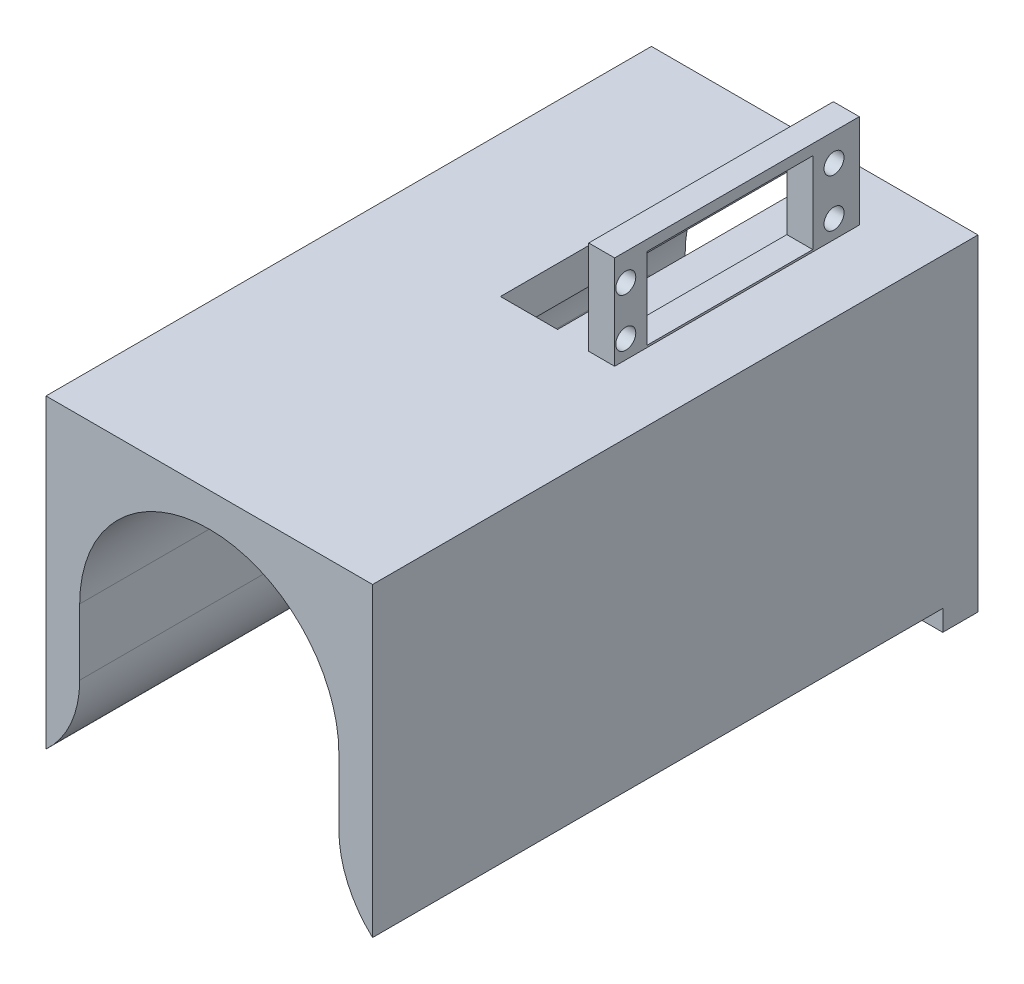
ISO-10303-21;
HEADER;
FILE_DESCRIPTION(('STEP AP214'),'2;1');
FILE_NAME('part.step','',(''),(''),'','','');
FILE_SCHEMA(('AUTOMOTIVE_DESIGN { 1 0 10303 214 1 1 1 1 }'));
ENDSEC;
DATA;
#1=APPLICATION_CONTEXT('core data for automotive mechanical design processes');
#2=APPLICATION_PROTOCOL_DEFINITION('international standard','automotive_design',2000,#1);
#3=PRODUCT_CONTEXT('',#1,'mechanical');
#4=PRODUCT('Part','Part','',(#3));
#5=PRODUCT_RELATED_PRODUCT_CATEGORY('part','',(#4));
#6=PRODUCT_DEFINITION_FORMATION('','',#4);
#7=PRODUCT_DEFINITION_CONTEXT('part definition',#1,'design');
#8=PRODUCT_DEFINITION('design','',#6,#7);
#9=PRODUCT_DEFINITION_SHAPE('','',#8);
#10=(LENGTH_UNIT() NAMED_UNIT(*) SI_UNIT(.MILLI.,.METRE.));
#11=(NAMED_UNIT(*) PLANE_ANGLE_UNIT() SI_UNIT($,.RADIAN.));
#12=(NAMED_UNIT(*) SI_UNIT($,.STERADIAN.) SOLID_ANGLE_UNIT());
#13=UNCERTAINTY_MEASURE_WITH_UNIT(LENGTH_MEASURE(1.E-05),#10,'distance_accuracy_value','');
#14=(GEOMETRIC_REPRESENTATION_CONTEXT(3) GLOBAL_UNCERTAINTY_ASSIGNED_CONTEXT((#13)) GLOBAL_UNIT_ASSIGNED_CONTEXT((#10,
#11,#12)) REPRESENTATION_CONTEXT('',''));
#15=CARTESIAN_POINT('',(0.,0.,0.));
#16=DIRECTION('',(0.,0.,1.));
#17=DIRECTION('',(1.,0.,0.));
#18=AXIS2_PLACEMENT_3D('',#15,#16,#17);
#19=CARTESIAN_POINT('',(-40.005,40.005,2.54));
#20=DIRECTION('',(0.,-1.,0.));
#21=DIRECTION('',(0.,0.,-1.));
#22=AXIS2_PLACEMENT_3D('',#19,#20,#21);
#23=PLANE('',#22);
#24=DIRECTION('',(-1.,0.,0.));
#25=VECTOR('',#24,1.);
#26=CARTESIAN_POINT('',(-40.005,40.005,0.));
#27=LINE('',#26,#25);
#28=CARTESIAN_POINT('',(40.005,40.005,0.));
#29=VERTEX_POINT('',#28);
#30=CARTESIAN_POINT('',(8.568,40.005,0.));
#31=VERTEX_POINT('',#30);
#32=EDGE_CURVE('E350',#29,#31,#27,.T.);
#33=ORIENTED_EDGE('',*,*,#32,.T.);
#34=DIRECTION('',(0.,0.,-1.));
#35=VECTOR('',#34,1.);
#36=CARTESIAN_POINT('',(8.568,40.005,71.5702352680382));
#37=LINE('',#36,#35);
#38=CARTESIAN_POINT('',(8.568,40.005,71.5702352680382));
#39=VERTEX_POINT('',#38);
#40=EDGE_CURVE('E201',#39,#31,#37,.T.);
#41=ORIENTED_EDGE('',*,*,#40,.F.);
#42=DIRECTION('',(1.,0.,0.));
#43=VECTOR('',#42,1.);
#44=CARTESIAN_POINT('',(8.568,40.005,71.5702352680382));
#45=LINE('',#44,#43);
#46=CARTESIAN_POINT('',(-5.432,40.005,71.5702352680382));
#47=VERTEX_POINT('',#46);
#48=EDGE_CURVE('E188',#47,#39,#45,.T.);
#49=ORIENTED_EDGE('',*,*,#48,.F.);
#50=DIRECTION('',(0.,0.,1.));
#51=VECTOR('',#50,1.);
#52=CARTESIAN_POINT('',(-5.432,40.005,71.5702352680382));
#53=LINE('',#52,#51);
#54=CARTESIAN_POINT('',(-5.432,40.005,0.));
#55=VERTEX_POINT('',#54);
#56=EDGE_CURVE('E195',#55,#47,#53,.T.);
#57=ORIENTED_EDGE('',*,*,#56,.F.);
#58=CARTESIAN_POINT('',(-40.005,40.005,0.));
#59=VERTEX_POINT('',#58);
#60=EDGE_CURVE('E349',#55,#59,#27,.T.);
#61=ORIENTED_EDGE('',*,*,#60,.T.);
#62=DIRECTION('',(0.,0.,-1.));
#63=VECTOR('',#62,1.);
#64=CARTESIAN_POINT('',(-40.005,40.005,2.54));
#65=LINE('',#64,#63);
#66=CARTESIAN_POINT('',(-40.005,40.005,148.336));
#67=VERTEX_POINT('',#66);
#68=EDGE_CURVE('E362',#67,#59,#65,.T.);
#69=ORIENTED_EDGE('',*,*,#68,.F.);
#70=DIRECTION('',(-1.,0.,0.));
#71=VECTOR('',#70,1.);
#72=CARTESIAN_POINT('',(-40.005,40.005,148.336));
#73=LINE('',#72,#71);
#74=CARTESIAN_POINT('',(40.005,40.005,148.336));
#75=VERTEX_POINT('',#74);
#76=EDGE_CURVE('E343',#75,#67,#73,.T.);
#77=ORIENTED_EDGE('',*,*,#76,.F.);
#78=DIRECTION('',(0.,0.,-1.));
#79=VECTOR('',#78,1.);
#80=CARTESIAN_POINT('',(40.005,40.005,2.54));
#81=LINE('',#80,#79);
#82=EDGE_CURVE('E365',#75,#29,#81,.T.);
#83=ORIENTED_EDGE('',*,*,#82,.T.);
#84=EDGE_LOOP('',(#33,#41,#49,#57,#61,#69,#77,#83));
#85=FACE_BOUND('',#84,.T.);
#86=DIRECTION('',(0.,0.,1.));
#87=VECTOR('',#86,1.);
#88=CARTESIAN_POINT('',(17.018,40.005,72.39));
#89=LINE('',#88,#87);
#90=CARTESIAN_POINT('',(17.018,40.005,12.446));
#91=VERTEX_POINT('',#90);
#92=CARTESIAN_POINT('',(17.018,40.005,72.39));
#93=VERTEX_POINT('',#92);
#94=EDGE_CURVE('E266',#91,#93,#89,.T.);
#95=ORIENTED_EDGE('',*,*,#94,.F.);
#96=DIRECTION('',(-1.,0.,0.));
#97=VECTOR('',#96,1.);
#98=CARTESIAN_POINT('',(23.368,40.005,12.446));
#99=LINE('',#98,#97);
#100=CARTESIAN_POINT('',(23.368,40.005,12.446));
#101=VERTEX_POINT('',#100);
#102=EDGE_CURVE('E271',#101,#91,#99,.T.);
#103=ORIENTED_EDGE('',*,*,#102,.F.);
#104=DIRECTION('',(0.,0.,-1.));
#105=VECTOR('',#104,1.);
#106=CARTESIAN_POINT('',(23.368,40.005,72.39));
#107=LINE('',#106,#105);
#108=CARTESIAN_POINT('',(23.368,40.005,72.39));
#109=VERTEX_POINT('',#108);
#110=EDGE_CURVE('E283',#109,#101,#107,.T.);
#111=ORIENTED_EDGE('',*,*,#110,.F.);
#112=DIRECTION('',(1.,0.,0.));
#113=VECTOR('',#112,1.);
#114=CARTESIAN_POINT('',(23.368,40.005,72.39));
#115=LINE('',#114,#113);
#116=EDGE_CURVE('E280',#93,#109,#115,.T.);
#117=ORIENTED_EDGE('',*,*,#116,.F.);
#118=EDGE_LOOP('',(#95,#103,#111,#117));
#119=FACE_BOUND('',#118,.T.);
#120=ADVANCED_FACE('F37',(#85,#119),#23,.F.);
#121=CARTESIAN_POINT('',(0.,0.,148.336));
#122=DIRECTION('',(0.,0.,1.));
#123=DIRECTION('',(1.,0.,0.));
#124=AXIS2_PLACEMENT_3D('',#121,#122,#123);
#125=PLANE('',#124);
#126=DIRECTION('',(0.,-1.,0.));
#127=VECTOR('',#126,1.);
#128=CARTESIAN_POINT('',(31.75,0.,148.336));
#129=LINE('',#128,#127);
#130=CARTESIAN_POINT('',(31.75,0.,148.336));
#131=VERTEX_POINT('',#130);
#132=CARTESIAN_POINT('',(31.75,-16.1844297045154,148.336));
#133=VERTEX_POINT('',#132);
#134=EDGE_CURVE('E299',#131,#133,#129,.T.);
#135=ORIENTED_EDGE('',*,*,#134,.T.);
#136=CARTESIAN_POINT('',(57.15,-16.1844297045154,148.336));
#137=DIRECTION('',(0.,0.,1.));
#138=DIRECTION('',(1.,0.,0.));
#139=AXIS2_PLACEMENT_3D('',#136,#137,#138);
#140=CIRCLE('',#139,25.4);
#141=CARTESIAN_POINT('',(40.005,-34.925,148.336));
#142=VERTEX_POINT('',#141);
#143=EDGE_CURVE('E373',#133,#142,#140,.T.);
#144=ORIENTED_EDGE('',*,*,#143,.T.);
#145=DIRECTION('',(0.,1.,0.));
#146=VECTOR('',#145,1.);
#147=CARTESIAN_POINT('',(40.005,40.005,148.336));
#148=LINE('',#147,#146);
#149=EDGE_CURVE('E341',#142,#75,#148,.T.);
#150=ORIENTED_EDGE('',*,*,#149,.T.);
#151=ORIENTED_EDGE('',*,*,#76,.T.);
#152=DIRECTION('',(0.,-1.,0.));
#153=VECTOR('',#152,1.);
#154=CARTESIAN_POINT('',(-40.005,40.005,148.336));
#155=LINE('',#154,#153);
#156=CARTESIAN_POINT('',(-40.005,-34.925,148.336));
#157=VERTEX_POINT('',#156);
#158=EDGE_CURVE('E338',#67,#157,#155,.T.);
#159=ORIENTED_EDGE('',*,*,#158,.T.);
#160=CARTESIAN_POINT('',(-57.15,-16.1844297045154,148.336));
#161=DIRECTION('',(0.,0.,1.));
#162=DIRECTION('',(1.,0.,0.));
#163=AXIS2_PLACEMENT_3D('',#160,#161,#162);
#164=CIRCLE('',#163,25.4);
#165=CARTESIAN_POINT('',(-31.75,-16.1844297045154,148.336));
#166=VERTEX_POINT('',#165);
#167=EDGE_CURVE('E371',#157,#166,#164,.T.);
#168=ORIENTED_EDGE('',*,*,#167,.T.);
#169=DIRECTION('',(0.,-1.,0.));
#170=VECTOR('',#169,1.);
#171=CARTESIAN_POINT('',(-31.75,0.,148.336));
#172=LINE('',#171,#170);
#173=CARTESIAN_POINT('',(-31.75,0.,148.336));
#174=VERTEX_POINT('',#173);
#175=EDGE_CURVE('E304',#174,#166,#172,.T.);
#176=ORIENTED_EDGE('',*,*,#175,.F.);
#177=CARTESIAN_POINT('',(0.,0.,148.336));
#178=DIRECTION('',(0.,0.,1.));
#179=DIRECTION('',(1.,0.,0.));
#180=AXIS2_PLACEMENT_3D('',#177,#178,#179);
#181=CIRCLE('',#180,31.75);
#182=EDGE_CURVE('E317',#131,#174,#181,.T.);
#183=ORIENTED_EDGE('',*,*,#182,.F.);
#184=EDGE_LOOP('',(#135,#144,#150,#151,#159,#168,#176,#183));
#185=FACE_BOUND('',#184,.T.);
#186=ADVANCED_FACE('F398',(#185),#125,.T.);
#187=CARTESIAN_POINT('',(40.005,-40.005,2.54));
#188=DIRECTION('',(-1.,0.,0.));
#189=DIRECTION('',(0.,0.,1.));
#190=AXIS2_PLACEMENT_3D('',#187,#188,#189);
#191=PLANE('',#190);
#192=DIRECTION('',(0.,0.,1.));
#193=VECTOR('',#192,1.);
#194=CARTESIAN_POINT('',(40.005,-34.925,0.));
#195=LINE('',#194,#193);
#196=CARTESIAN_POINT('',(40.005,-34.925,8.636));
#197=VERTEX_POINT('',#196);
#198=EDGE_CURVE('E326',#197,#142,#195,.T.);
#199=ORIENTED_EDGE('',*,*,#198,.F.);
#200=DIRECTION('',(0.,-1.,0.));
#201=VECTOR('',#200,1.);
#202=CARTESIAN_POINT('',(40.005,-34.925,8.636));
#203=LINE('',#202,#201);
#204=CARTESIAN_POINT('',(40.005,-40.005,8.636));
#205=VERTEX_POINT('',#204);
#206=EDGE_CURVE('E331',#197,#205,#203,.T.);
#207=ORIENTED_EDGE('',*,*,#206,.T.);
#208=DIRECTION('',(0.,0.,-1.));
#209=VECTOR('',#208,1.);
#210=CARTESIAN_POINT('',(40.005,-40.005,2.54));
#211=LINE('',#210,#209);
#212=CARTESIAN_POINT('',(40.005,-40.005,0.));
#213=VERTEX_POINT('',#212);
#214=EDGE_CURVE('E358',#205,#213,#211,.T.);
#215=ORIENTED_EDGE('',*,*,#214,.T.);
#216=DIRECTION('',(0.,1.,0.));
#217=VECTOR('',#216,1.);
#218=CARTESIAN_POINT('',(40.005,-40.005,0.));
#219=LINE('',#218,#217);
#220=EDGE_CURVE('E346',#213,#29,#219,.T.);
#221=ORIENTED_EDGE('',*,*,#220,.T.);
#222=ORIENTED_EDGE('',*,*,#82,.F.);
#223=ORIENTED_EDGE('',*,*,#149,.F.);
#224=EDGE_LOOP('',(#199,#207,#215,#221,#222,#223));
#225=FACE_BOUND('',#224,.T.);
#226=ADVANCED_FACE('F405',(#225),#191,.F.);
#227=CARTESIAN_POINT('',(-40.005,-40.005,2.54));
#228=DIRECTION('',(1.,0.,0.));
#229=DIRECTION('',(0.,0.,-1.));
#230=AXIS2_PLACEMENT_3D('',#227,#228,#229);
#231=PLANE('',#230);
#232=DIRECTION('',(0.,0.,-1.));
#233=VECTOR('',#232,1.);
#234=CARTESIAN_POINT('',(-40.005,-40.005,2.54));
#235=LINE('',#234,#233);
#236=CARTESIAN_POINT('',(-40.005,-40.005,8.636));
#237=VERTEX_POINT('',#236);
#238=CARTESIAN_POINT('',(-40.005,-40.005,0.));
#239=VERTEX_POINT('',#238);
#240=EDGE_CURVE('E360',#237,#239,#235,.T.);
#241=ORIENTED_EDGE('',*,*,#240,.F.);
#242=DIRECTION('',(0.,-1.,0.));
#243=VECTOR('',#242,1.);
#244=CARTESIAN_POINT('',(-40.005,-34.925,8.636));
#245=LINE('',#244,#243);
#246=CARTESIAN_POINT('',(-40.005,-34.925,8.636));
#247=VERTEX_POINT('',#246);
#248=EDGE_CURVE('E329',#247,#237,#245,.T.);
#249=ORIENTED_EDGE('',*,*,#248,.F.);
#250=DIRECTION('',(0.,0.,-1.));
#251=VECTOR('',#250,1.);
#252=CARTESIAN_POINT('',(-40.005,-34.925,0.));
#253=LINE('',#252,#251);
#254=EDGE_CURVE('E323',#157,#247,#253,.T.);
#255=ORIENTED_EDGE('',*,*,#254,.F.);
#256=ORIENTED_EDGE('',*,*,#158,.F.);
#257=ORIENTED_EDGE('',*,*,#68,.T.);
#258=DIRECTION('',(0.,-1.,0.));
#259=VECTOR('',#258,1.);
#260=CARTESIAN_POINT('',(-40.005,-40.005,0.));
#261=LINE('',#260,#259);
#262=EDGE_CURVE('E352',#59,#239,#261,.T.);
#263=ORIENTED_EDGE('',*,*,#262,.T.);
#264=EDGE_LOOP('',(#241,#249,#255,#256,#257,#263));
#265=FACE_BOUND('',#264,.T.);
#266=ADVANCED_FACE('F394',(#265),#231,.F.);
#267=CARTESIAN_POINT('',(-40.005,-40.005,2.54));
#268=DIRECTION('',(0.,1.,0.));
#269=DIRECTION('',(0.,0.,1.));
#270=AXIS2_PLACEMENT_3D('',#267,#268,#269);
#271=PLANE('',#270);
#272=ORIENTED_EDGE('',*,*,#214,.F.);
#273=DIRECTION('',(1.,0.,0.));
#274=VECTOR('',#273,1.);
#275=CARTESIAN_POINT('',(0.,-40.005,8.636));
#276=LINE('',#275,#274);
#277=EDGE_CURVE('E322',#237,#205,#276,.T.);
#278=ORIENTED_EDGE('',*,*,#277,.F.);
#279=ORIENTED_EDGE('',*,*,#240,.T.);
#280=DIRECTION('',(1.,0.,0.));
#281=VECTOR('',#280,1.);
#282=CARTESIAN_POINT('',(-40.005,-40.005,0.));
#283=LINE('',#282,#281);
#284=EDGE_CURVE('E355',#239,#213,#283,.T.);
#285=ORIENTED_EDGE('',*,*,#284,.T.);
#286=EDGE_LOOP('',(#272,#278,#279,#285));
#287=FACE_BOUND('',#286,.T.);
#288=ADVANCED_FACE('F456',(#287),#271,.F.);
#289=CARTESIAN_POINT('',(0.,0.,0.));
#290=DIRECTION('',(0.,0.,-1.));
#291=DIRECTION('',(-1.,0.,0.));
#292=AXIS2_PLACEMENT_3D('',#289,#290,#291);
#293=PLANE('',#292);
#294=DIRECTION('',(0.,-1.,0.));
#295=VECTOR('',#294,1.);
#296=CARTESIAN_POINT('',(8.568,0.,0.));
#297=LINE('',#296,#295);
#298=CARTESIAN_POINT('',(8.568,30.5720767367871,0.));
#299=VERTEX_POINT('',#298);
#300=EDGE_CURVE('E210',#31,#299,#297,.T.);
#301=ORIENTED_EDGE('',*,*,#300,.F.);
#302=ORIENTED_EDGE('',*,*,#32,.F.);
#303=ORIENTED_EDGE('',*,*,#220,.F.);
#304=ORIENTED_EDGE('',*,*,#284,.F.);
#305=ORIENTED_EDGE('',*,*,#262,.F.);
#306=ORIENTED_EDGE('',*,*,#60,.F.);
#307=DIRECTION('',(0.,1.,0.));
#308=VECTOR('',#307,1.);
#309=CARTESIAN_POINT('',(-5.432,0.,0.));
#310=LINE('',#309,#308);
#311=CARTESIAN_POINT('',(-5.432,31.2818777569378,0.));
#312=VERTEX_POINT('',#311);
#313=EDGE_CURVE('E198',#312,#55,#310,.T.);
#314=ORIENTED_EDGE('',*,*,#313,.F.);
#315=CARTESIAN_POINT('',(0.,0.,0.));
#316=DIRECTION('',(0.,0.,-1.));
#317=DIRECTION('',(-1.,0.,0.));
#318=AXIS2_PLACEMENT_3D('',#315,#316,#317);
#319=CIRCLE('',#318,31.75);
#320=EDGE_CURVE('E334',#299,#312,#319,.T.);
#321=ORIENTED_EDGE('',*,*,#320,.F.);
#322=EDGE_LOOP('',(#301,#302,#303,#304,#305,#306,#314,#321));
#323=FACE_BOUND('',#322,.T.);
#324=ADVANCED_FACE('F387',(#323),#293,.T.);
#325=CARTESIAN_POINT('',(0.,0.,69.85));
#326=DIRECTION('',(0.,0.,-1.));
#327=DIRECTION('',(-1.,0.,0.));
#328=AXIS2_PLACEMENT_3D('',#325,#326,#327);
#329=CYLINDRICAL_SURFACE('',#328,31.75);
#330=CARTESIAN_POINT('',(0.,0.,8.636));
#331=DIRECTION('',(0.,0.,1.));
#332=DIRECTION('',(1.,0.,0.));
#333=AXIS2_PLACEMENT_3D('',#330,#331,#332);
#334=CIRCLE('',#333,31.75);
#335=CARTESIAN_POINT('',(31.75,0.,8.636));
#336=VERTEX_POINT('',#335);
#337=CARTESIAN_POINT('',(-31.75,0.,8.636));
#338=VERTEX_POINT('',#337);
#339=EDGE_CURVE('E303',#336,#338,#334,.F.);
#340=ORIENTED_EDGE('',*,*,#339,.F.);
#341=DIRECTION('',(0.,0.,1.));
#342=VECTOR('',#341,1.);
#343=CARTESIAN_POINT('',(31.75,0.,8.636));
#344=LINE('',#343,#342);
#345=EDGE_CURVE('E310',#336,#131,#344,.T.);
#346=ORIENTED_EDGE('',*,*,#345,.T.);
#347=ORIENTED_EDGE('',*,*,#182,.T.);
#348=DIRECTION('',(0.,0.,1.));
#349=VECTOR('',#348,1.);
#350=CARTESIAN_POINT('',(-31.75,0.,8.636));
#351=LINE('',#350,#349);
#352=EDGE_CURVE('E315',#338,#174,#351,.T.);
#353=ORIENTED_EDGE('',*,*,#352,.F.);
#354=EDGE_LOOP('',(#340,#346,#347,#353));
#355=FACE_BOUND('',#354,.T.);
#356=CARTESIAN_POINT('',(0.,0.,71.5702352680382));
#357=DIRECTION('',(0.,0.,1.));
#358=DIRECTION('',(1.,0.,0.));
#359=AXIS2_PLACEMENT_3D('',#356,#357,#358);
#360=CIRCLE('',#359,31.75);
#361=CARTESIAN_POINT('',(-5.432,31.2818777569378,71.5702352680382));
#362=VERTEX_POINT('',#361);
#363=CARTESIAN_POINT('',(8.568,30.5720767367871,71.5702352680382));
#364=VERTEX_POINT('',#363);
#365=EDGE_CURVE('E45',#362,#364,#360,.F.);
#366=ORIENTED_EDGE('',*,*,#365,.T.);
#367=DIRECTION('',(0.,0.,-1.));
#368=VECTOR('',#367,1.);
#369=CARTESIAN_POINT('',(8.568,30.5720767367871,69.85));
#370=LINE('',#369,#368);
#371=EDGE_CURVE('E11',#364,#299,#370,.T.);
#372=ORIENTED_EDGE('',*,*,#371,.T.);
#373=ORIENTED_EDGE('',*,*,#320,.T.);
#374=DIRECTION('',(0.,0.,-1.));
#375=VECTOR('',#374,1.);
#376=CARTESIAN_POINT('',(-5.432,31.2818777569378,69.85));
#377=LINE('',#376,#375);
#378=EDGE_CURVE('E381',#312,#362,#377,.F.);
#379=ORIENTED_EDGE('',*,*,#378,.T.);
#380=EDGE_LOOP('',(#366,#372,#373,#379));
#381=FACE_BOUND('',#380,.T.);
#382=ADVANCED_FACE('F383',(#355,#381),#329,.F.);
#383=CARTESIAN_POINT('',(0.,-34.925,8.636));
#384=DIRECTION('',(0.,0.,-1.));
#385=DIRECTION('',(-1.,0.,0.));
#386=AXIS2_PLACEMENT_3D('',#383,#384,#385);
#387=PLANE('',#386);
#388=ORIENTED_EDGE('',*,*,#277,.T.);
#389=ORIENTED_EDGE('',*,*,#206,.F.);
#390=CARTESIAN_POINT('',(57.15,-16.1844297045154,8.636));
#391=DIRECTION('',(0.,0.,-1.));
#392=DIRECTION('',(-1.,0.,0.));
#393=AXIS2_PLACEMENT_3D('',#390,#391,#392);
#394=CIRCLE('',#393,25.4);
#395=CARTESIAN_POINT('',(31.75,-16.1844297045154,8.636));
#396=VERTEX_POINT('',#395);
#397=EDGE_CURVE('E377',#197,#396,#394,.T.);
#398=ORIENTED_EDGE('',*,*,#397,.T.);
#399=DIRECTION('',(0.,-1.,0.));
#400=VECTOR('',#399,1.);
#401=CARTESIAN_POINT('',(31.75,0.,8.636));
#402=LINE('',#401,#400);
#403=EDGE_CURVE('E300',#336,#396,#402,.T.);
#404=ORIENTED_EDGE('',*,*,#403,.F.);
#405=ORIENTED_EDGE('',*,*,#339,.T.);
#406=DIRECTION('',(0.,-1.,0.));
#407=VECTOR('',#406,1.);
#408=CARTESIAN_POINT('',(-31.75,0.,8.636));
#409=LINE('',#408,#407);
#410=CARTESIAN_POINT('',(-31.75,-16.1844297045154,8.636));
#411=VERTEX_POINT('',#410);
#412=EDGE_CURVE('E307',#338,#411,#409,.T.);
#413=ORIENTED_EDGE('',*,*,#412,.T.);
#414=CARTESIAN_POINT('',(-57.15,-16.1844297045154,8.636));
#415=DIRECTION('',(0.,0.,-1.));
#416=DIRECTION('',(-1.,0.,0.));
#417=AXIS2_PLACEMENT_3D('',#414,#415,#416);
#418=CIRCLE('',#417,25.4);
#419=EDGE_CURVE('E379',#411,#247,#418,.T.);
#420=ORIENTED_EDGE('',*,*,#419,.T.);
#421=ORIENTED_EDGE('',*,*,#248,.T.);
#422=EDGE_LOOP('',(#388,#389,#398,#404,#405,#413,#420,#421));
#423=FACE_BOUND('',#422,.T.);
#424=ADVANCED_FACE('F446',(#423),#387,.F.);
#425=CARTESIAN_POINT('',(31.75,0.,8.636));
#426=DIRECTION('',(-1.,0.,0.));
#427=DIRECTION('',(0.,0.,1.));
#428=AXIS2_PLACEMENT_3D('',#425,#426,#427);
#429=PLANE('',#428);
#430=ORIENTED_EDGE('',*,*,#403,.T.);
#431=DIRECTION('',(0.,0.,1.));
#432=VECTOR('',#431,1.);
#433=CARTESIAN_POINT('',(31.75,-16.1844297045154,148.336));
#434=LINE('',#433,#432);
#435=EDGE_CURVE('E368',#396,#133,#434,.T.);
#436=ORIENTED_EDGE('',*,*,#435,.T.);
#437=ORIENTED_EDGE('',*,*,#134,.F.);
#438=ORIENTED_EDGE('',*,*,#345,.F.);
#439=EDGE_LOOP('',(#430,#436,#437,#438));
#440=FACE_BOUND('',#439,.T.);
#441=ADVANCED_FACE('F439',(#440),#429,.T.);
#442=CARTESIAN_POINT('',(-31.75,0.,8.636));
#443=DIRECTION('',(-1.,0.,0.));
#444=DIRECTION('',(0.,0.,1.));
#445=AXIS2_PLACEMENT_3D('',#442,#443,#444);
#446=PLANE('',#445);
#447=ORIENTED_EDGE('',*,*,#175,.T.);
#448=DIRECTION('',(0.,0.,1.));
#449=VECTOR('',#448,1.);
#450=CARTESIAN_POINT('',(-31.75,-16.1844297045154,8.636));
#451=LINE('',#450,#449);
#452=EDGE_CURVE('E375',#166,#411,#451,.F.);
#453=ORIENTED_EDGE('',*,*,#452,.T.);
#454=ORIENTED_EDGE('',*,*,#412,.F.);
#455=ORIENTED_EDGE('',*,*,#352,.T.);
#456=EDGE_LOOP('',(#447,#453,#454,#455));
#457=FACE_BOUND('',#456,.T.);
#458=ADVANCED_FACE('F431',(#457),#446,.F.);
#459=CARTESIAN_POINT('',(57.15,-16.1844297045154,0.));
#460=DIRECTION('',(0.,0.,-1.));
#461=DIRECTION('',(-1.,0.,0.));
#462=AXIS2_PLACEMENT_3D('',#459,#460,#461);
#463=CYLINDRICAL_SURFACE('',#462,25.4);
#464=ORIENTED_EDGE('',*,*,#397,.F.);
#465=ORIENTED_EDGE('',*,*,#198,.T.);
#466=ORIENTED_EDGE('',*,*,#143,.F.);
#467=ORIENTED_EDGE('',*,*,#435,.F.);
#468=EDGE_LOOP('',(#464,#465,#466,#467));
#469=FACE_BOUND('',#468,.T.);
#470=ADVANCED_FACE('F429',(#469),#463,.T.);
#471=CARTESIAN_POINT('',(-57.15,-16.1844297045154,0.));
#472=DIRECTION('',(0.,0.,1.));
#473=DIRECTION('',(1.,0.,0.));
#474=AXIS2_PLACEMENT_3D('',#471,#472,#473);
#475=CYLINDRICAL_SURFACE('',#474,25.4);
#476=ORIENTED_EDGE('',*,*,#419,.F.);
#477=ORIENTED_EDGE('',*,*,#452,.F.);
#478=ORIENTED_EDGE('',*,*,#167,.F.);
#479=ORIENTED_EDGE('',*,*,#254,.T.);
#480=EDGE_LOOP('',(#476,#477,#478,#479));
#481=FACE_BOUND('',#480,.T.);
#482=ADVANCED_FACE('F39',(#481),#475,.T.);
#483=CARTESIAN_POINT('',(17.018,63.005,72.39));
#484=DIRECTION('',(1.,0.,0.));
#485=DIRECTION('',(0.,0.,-1.));
#486=AXIS2_PLACEMENT_3D('',#483,#484,#485);
#487=PLANE('',#486);
#488=CARTESIAN_POINT('',(17.018,56.2444527708158,18.6392147090301));
#489=DIRECTION('',(1.,0.,0.));
#490=DIRECTION('',(0.,0.,-1.));
#491=AXIS2_PLACEMENT_3D('',#488,#489,#490);
#492=CIRCLE('',#491,2.45000000000003);
#493=CARTESIAN_POINT('',(17.018,56.2444527708158,16.1892147090301));
#494=VERTEX_POINT('',#493);
#495=EDGE_CURVE('E263',#494,#494,#492,.T.);
#496=ORIENTED_EDGE('',*,*,#495,.T.);
#497=EDGE_LOOP('',(#496));
#498=FACE_BOUND('',#497,.T.);
#499=CARTESIAN_POINT('',(17.018,44.502596374907,18.6392147090301));
#500=DIRECTION('',(1.,0.,0.));
#501=DIRECTION('',(0.,0.,-1.));
#502=AXIS2_PLACEMENT_3D('',#499,#500,#501);
#503=CIRCLE('',#502,2.45);
#504=CARTESIAN_POINT('',(17.018,44.502596374907,16.1892147090301));
#505=VERTEX_POINT('',#504);
#506=EDGE_CURVE('E260',#505,#505,#503,.T.);
#507=ORIENTED_EDGE('',*,*,#506,.T.);
#508=EDGE_LOOP('',(#507));
#509=FACE_BOUND('',#508,.T.);
#510=CARTESIAN_POINT('',(17.018,56.4025963749075,69.6592147090301));
#511=DIRECTION('',(1.,0.,0.));
#512=DIRECTION('',(0.,0.,-1.));
#513=AXIS2_PLACEMENT_3D('',#510,#511,#512);
#514=CIRCLE('',#513,2.45000000000003);
#515=CARTESIAN_POINT('',(17.018,56.4025963749075,67.2092147090301));
#516=VERTEX_POINT('',#515);
#517=EDGE_CURVE('E257',#516,#516,#514,.T.);
#518=ORIENTED_EDGE('',*,*,#517,.T.);
#519=EDGE_LOOP('',(#518));
#520=FACE_BOUND('',#519,.T.);
#521=CARTESIAN_POINT('',(17.018,44.5025963749075,69.6592147090301));
#522=DIRECTION('',(1.,0.,0.));
#523=DIRECTION('',(0.,0.,-1.));
#524=AXIS2_PLACEMENT_3D('',#521,#522,#523);
#525=CIRCLE('',#524,2.45);
#526=CARTESIAN_POINT('',(17.018,44.5025963749075,67.2092147090301));
#527=VERTEX_POINT('',#526);
#528=EDGE_CURVE('E254',#527,#527,#525,.T.);
#529=ORIENTED_EDGE('',*,*,#528,.T.);
#530=EDGE_LOOP('',(#529));
#531=FACE_BOUND('',#530,.T.);
#532=DIRECTION('',(0.,0.,1.));
#533=VECTOR('',#532,1.);
#534=CARTESIAN_POINT('',(17.018,60.4025963749075,72.39));
#535=LINE('',#534,#533);
#536=CARTESIAN_POINT('',(17.018,60.4025963749075,23.8492147090301));
#537=VERTEX_POINT('',#536);
#538=CARTESIAN_POINT('',(17.018,60.4025963749075,64.4492147090301));
#539=VERTEX_POINT('',#538);
#540=EDGE_CURVE('E248',#537,#539,#535,.T.);
#541=ORIENTED_EDGE('',*,*,#540,.T.);
#542=DIRECTION('',(0.,-1.,0.));
#543=VECTOR('',#542,1.);
#544=CARTESIAN_POINT('',(17.018,63.005,64.4492147090301));
#545=LINE('',#544,#543);
#546=CARTESIAN_POINT('',(17.018,40.5025963749075,64.4492147090301));
#547=VERTEX_POINT('',#546);
#548=EDGE_CURVE('E251',#539,#547,#545,.T.);
#549=ORIENTED_EDGE('',*,*,#548,.T.);
#550=DIRECTION('',(0.,0.,-1.));
#551=VECTOR('',#550,1.);
#552=CARTESIAN_POINT('',(17.018,40.5025963749075,72.39));
#553=LINE('',#552,#551);
#554=CARTESIAN_POINT('',(17.018,40.5025963749075,23.8492147090301));
#555=VERTEX_POINT('',#554);
#556=EDGE_CURVE('E237',#547,#555,#553,.T.);
#557=ORIENTED_EDGE('',*,*,#556,.T.);
#558=DIRECTION('',(0.,1.,0.));
#559=VECTOR('',#558,1.);
#560=CARTESIAN_POINT('',(17.018,63.005,23.8492147090301));
#561=LINE('',#560,#559);
#562=EDGE_CURVE('E245',#555,#537,#561,.T.);
#563=ORIENTED_EDGE('',*,*,#562,.T.);
#564=EDGE_LOOP('',(#541,#549,#557,#563));
#565=FACE_BOUND('',#564,.T.);
#566=ORIENTED_EDGE('',*,*,#94,.T.);
#567=DIRECTION('',(0.,-1.,0.));
#568=VECTOR('',#567,1.);
#569=CARTESIAN_POINT('',(17.018,63.005,72.39));
#570=LINE('',#569,#568);
#571=CARTESIAN_POINT('',(17.018,63.005,72.39));
#572=VERTEX_POINT('',#571);
#573=EDGE_CURVE('E296',#572,#93,#570,.T.);
#574=ORIENTED_EDGE('',*,*,#573,.F.);
#575=DIRECTION('',(0.,0.,1.));
#576=VECTOR('',#575,1.);
#577=CARTESIAN_POINT('',(17.018,63.005,72.39));
#578=LINE('',#577,#576);
#579=CARTESIAN_POINT('',(17.018,63.005,12.446));
#580=VERTEX_POINT('',#579);
#581=EDGE_CURVE('E267',#580,#572,#578,.T.);
#582=ORIENTED_EDGE('',*,*,#581,.F.);
#583=DIRECTION('',(0.,-1.,0.));
#584=VECTOR('',#583,1.);
#585=CARTESIAN_POINT('',(17.018,63.005,12.446));
#586=LINE('',#585,#584);
#587=EDGE_CURVE('E277',#580,#91,#586,.T.);
#588=ORIENTED_EDGE('',*,*,#587,.T.);
#589=EDGE_LOOP('',(#566,#574,#582,#588));
#590=FACE_BOUND('',#589,.T.);
#591=ADVANCED_FACE('F437',(#498,#509,#520,#531,#565,#590),#487,.F.);
#592=CARTESIAN_POINT('',(23.368,63.005,72.39));
#593=DIRECTION('',(0.,0.,-1.));
#594=DIRECTION('',(-1.,0.,0.));
#595=AXIS2_PLACEMENT_3D('',#592,#593,#594);
#596=PLANE('',#595);
#597=ORIENTED_EDGE('',*,*,#116,.T.);
#598=DIRECTION('',(0.,-1.,0.));
#599=VECTOR('',#598,1.);
#600=CARTESIAN_POINT('',(23.368,63.005,72.39));
#601=LINE('',#600,#599);
#602=CARTESIAN_POINT('',(23.368,63.005,72.39));
#603=VERTEX_POINT('',#602);
#604=EDGE_CURVE('E293',#603,#109,#601,.T.);
#605=ORIENTED_EDGE('',*,*,#604,.F.);
#606=DIRECTION('',(1.,0.,0.));
#607=VECTOR('',#606,1.);
#608=CARTESIAN_POINT('',(23.368,63.005,72.39));
#609=LINE('',#608,#607);
#610=EDGE_CURVE('E270',#572,#603,#609,.T.);
#611=ORIENTED_EDGE('',*,*,#610,.F.);
#612=ORIENTED_EDGE('',*,*,#573,.T.);
#613=EDGE_LOOP('',(#597,#605,#611,#612));
#614=FACE_BOUND('',#613,.T.);
#615=ADVANCED_FACE('F472',(#614),#596,.F.);
#616=CARTESIAN_POINT('',(23.368,63.005,72.39));
#617=DIRECTION('',(-1.,0.,0.));
#618=DIRECTION('',(0.,0.,1.));
#619=AXIS2_PLACEMENT_3D('',#616,#617,#618);
#620=PLANE('',#619);
#621=CARTESIAN_POINT('',(23.368,56.2444527708158,18.6392147090301));
#622=DIRECTION('',(1.,0.,0.));
#623=DIRECTION('',(0.,0.,-1.));
#624=AXIS2_PLACEMENT_3D('',#621,#622,#623);
#625=CIRCLE('',#624,2.45000000000003);
#626=CARTESIAN_POINT('',(23.368,56.2444527708158,16.1892147090301));
#627=VERTEX_POINT('',#626);
#628=EDGE_CURVE('E212',#627,#627,#625,.T.);
#629=ORIENTED_EDGE('',*,*,#628,.F.);
#630=EDGE_LOOP('',(#629));
#631=FACE_BOUND('',#630,.T.);
#632=CARTESIAN_POINT('',(23.368,44.502596374907,18.6392147090301));
#633=DIRECTION('',(1.,0.,0.));
#634=DIRECTION('',(0.,0.,-1.));
#635=AXIS2_PLACEMENT_3D('',#632,#633,#634);
#636=CIRCLE('',#635,2.45);
#637=CARTESIAN_POINT('',(23.368,44.502596374907,16.1892147090301));
#638=VERTEX_POINT('',#637);
#639=EDGE_CURVE('E220',#638,#638,#636,.T.);
#640=ORIENTED_EDGE('',*,*,#639,.F.);
#641=EDGE_LOOP('',(#640));
#642=FACE_BOUND('',#641,.T.);
#643=CARTESIAN_POINT('',(23.368,56.4025963749075,69.6592147090301));
#644=DIRECTION('',(1.,0.,0.));
#645=DIRECTION('',(0.,0.,-1.));
#646=AXIS2_PLACEMENT_3D('',#643,#644,#645);
#647=CIRCLE('',#646,2.45000000000003);
#648=CARTESIAN_POINT('',(23.368,56.4025963749075,67.2092147090301));
#649=VERTEX_POINT('',#648);
#650=EDGE_CURVE('E217',#649,#649,#647,.T.);
#651=ORIENTED_EDGE('',*,*,#650,.F.);
#652=EDGE_LOOP('',(#651));
#653=FACE_BOUND('',#652,.T.);
#654=CARTESIAN_POINT('',(23.368,44.5025963749075,69.6592147090301));
#655=DIRECTION('',(1.,0.,0.));
#656=DIRECTION('',(0.,0.,-1.));
#657=AXIS2_PLACEMENT_3D('',#654,#655,#656);
#658=CIRCLE('',#657,2.45);
#659=CARTESIAN_POINT('',(23.368,44.5025963749075,67.2092147090301));
#660=VERTEX_POINT('',#659);
#661=EDGE_CURVE('E213',#660,#660,#658,.T.);
#662=ORIENTED_EDGE('',*,*,#661,.F.);
#663=EDGE_LOOP('',(#662));
#664=FACE_BOUND('',#663,.T.);
#665=DIRECTION('',(0.,0.,-1.));
#666=VECTOR('',#665,1.);
#667=CARTESIAN_POINT('',(23.368,40.5025963749075,64.4492147090301));
#668=LINE('',#667,#666);
#669=CARTESIAN_POINT('',(23.368,40.5025963749075,64.4492147090301));
#670=VERTEX_POINT('',#669);
#671=CARTESIAN_POINT('',(23.368,40.5025963749075,23.8492147090301));
#672=VERTEX_POINT('',#671);
#673=EDGE_CURVE('E226',#670,#672,#668,.T.);
#674=ORIENTED_EDGE('',*,*,#673,.F.);
#675=DIRECTION('',(0.,-1.,0.));
#676=VECTOR('',#675,1.);
#677=CARTESIAN_POINT('',(23.368,40.5025963749075,64.4492147090301));
#678=LINE('',#677,#676);
#679=CARTESIAN_POINT('',(23.368,60.4025963749075,64.4492147090301));
#680=VERTEX_POINT('',#679);
#681=EDGE_CURVE('E216',#680,#670,#678,.T.);
#682=ORIENTED_EDGE('',*,*,#681,.F.);
#683=DIRECTION('',(0.,0.,1.));
#684=VECTOR('',#683,1.);
#685=CARTESIAN_POINT('',(23.368,60.4025963749075,64.4492147090301));
#686=LINE('',#685,#684);
#687=CARTESIAN_POINT('',(23.368,60.4025963749075,23.8492147090301));
#688=VERTEX_POINT('',#687);
#689=EDGE_CURVE('E231',#688,#680,#686,.T.);
#690=ORIENTED_EDGE('',*,*,#689,.F.);
#691=DIRECTION('',(0.,1.,0.));
#692=VECTOR('',#691,1.);
#693=CARTESIAN_POINT('',(23.368,40.5025963749075,23.8492147090301));
#694=LINE('',#693,#692);
#695=EDGE_CURVE('E228',#672,#688,#694,.T.);
#696=ORIENTED_EDGE('',*,*,#695,.F.);
#697=EDGE_LOOP('',(#674,#682,#690,#696));
#698=FACE_BOUND('',#697,.T.);
#699=ORIENTED_EDGE('',*,*,#110,.T.);
#700=DIRECTION('',(0.,-1.,0.));
#701=VECTOR('',#700,1.);
#702=CARTESIAN_POINT('',(23.368,63.005,12.446));
#703=LINE('',#702,#701);
#704=CARTESIAN_POINT('',(23.368,63.005,12.446));
#705=VERTEX_POINT('',#704);
#706=EDGE_CURVE('E290',#705,#101,#703,.T.);
#707=ORIENTED_EDGE('',*,*,#706,.F.);
#708=DIRECTION('',(0.,0.,-1.));
#709=VECTOR('',#708,1.);
#710=CARTESIAN_POINT('',(23.368,63.005,72.39));
#711=LINE('',#710,#709);
#712=EDGE_CURVE('E273',#603,#705,#711,.T.);
#713=ORIENTED_EDGE('',*,*,#712,.F.);
#714=ORIENTED_EDGE('',*,*,#604,.T.);
#715=EDGE_LOOP('',(#699,#707,#713,#714));
#716=FACE_BOUND('',#715,.T.);
#717=ADVANCED_FACE('F476',(#631,#642,#653,#664,#698,#716),#620,.F.);
#718=CARTESIAN_POINT('',(23.368,63.005,12.446));
#719=DIRECTION('',(0.,0.,1.));
#720=DIRECTION('',(1.,0.,0.));
#721=AXIS2_PLACEMENT_3D('',#718,#719,#720);
#722=PLANE('',#721);
#723=ORIENTED_EDGE('',*,*,#102,.T.);
#724=ORIENTED_EDGE('',*,*,#587,.F.);
#725=DIRECTION('',(-1.,0.,0.));
#726=VECTOR('',#725,1.);
#727=CARTESIAN_POINT('',(23.368,63.005,12.446));
#728=LINE('',#727,#726);
#729=EDGE_CURVE('E275',#705,#580,#728,.T.);
#730=ORIENTED_EDGE('',*,*,#729,.F.);
#731=ORIENTED_EDGE('',*,*,#706,.T.);
#732=EDGE_LOOP('',(#723,#724,#730,#731));
#733=FACE_BOUND('',#732,.T.);
#734=ADVANCED_FACE('F480',(#733),#722,.F.);
#735=CARTESIAN_POINT('',(0.,63.005,0.));
#736=DIRECTION('',(0.,1.,0.));
#737=DIRECTION('',(0.,0.,1.));
#738=AXIS2_PLACEMENT_3D('',#735,#736,#737);
#739=PLANE('',#738);
#740=ORIENTED_EDGE('',*,*,#581,.T.);
#741=ORIENTED_EDGE('',*,*,#610,.T.);
#742=ORIENTED_EDGE('',*,*,#712,.T.);
#743=ORIENTED_EDGE('',*,*,#729,.T.);
#744=EDGE_LOOP('',(#740,#741,#742,#743));
#745=FACE_BOUND('',#744,.T.);
#746=ADVANCED_FACE('F484',(#745),#739,.T.);
#747=CARTESIAN_POINT('',(0.368,40.5025963749075,64.4492147090301));
#748=DIRECTION('',(0.,0.,1.));
#749=DIRECTION('',(1.,0.,0.));
#750=AXIS2_PLACEMENT_3D('',#747,#748,#749);
#751=PLANE('',#750);
#752=DIRECTION('',(1.,0.,0.));
#753=VECTOR('',#752,1.);
#754=CARTESIAN_POINT('',(0.368,60.4025963749075,64.4492147090301));
#755=LINE('',#754,#753);
#756=EDGE_CURVE('E235',#539,#680,#755,.T.);
#757=ORIENTED_EDGE('',*,*,#756,.T.);
#758=ORIENTED_EDGE('',*,*,#681,.T.);
#759=DIRECTION('',(1.,0.,0.));
#760=VECTOR('',#759,1.);
#761=CARTESIAN_POINT('',(0.368,40.5025963749075,64.4492147090301));
#762=LINE('',#761,#760);
#763=EDGE_CURVE('E234',#547,#670,#762,.T.);
#764=ORIENTED_EDGE('',*,*,#763,.F.);
#765=ORIENTED_EDGE('',*,*,#548,.F.);
#766=EDGE_LOOP('',(#757,#758,#764,#765));
#767=FACE_BOUND('',#766,.T.);
#768=ADVANCED_FACE('F488',(#767),#751,.F.);
#769=CARTESIAN_POINT('',(0.368,60.4025963749075,64.4492147090301));
#770=DIRECTION('',(0.,1.,0.));
#771=DIRECTION('',(0.,0.,1.));
#772=AXIS2_PLACEMENT_3D('',#769,#770,#771);
#773=PLANE('',#772);
#774=DIRECTION('',(1.,0.,0.));
#775=VECTOR('',#774,1.);
#776=CARTESIAN_POINT('',(0.368,60.4025963749075,23.8492147090301));
#777=LINE('',#776,#775);
#778=EDGE_CURVE('E238',#537,#688,#777,.T.);
#779=ORIENTED_EDGE('',*,*,#778,.T.);
#780=ORIENTED_EDGE('',*,*,#689,.T.);
#781=ORIENTED_EDGE('',*,*,#756,.F.);
#782=ORIENTED_EDGE('',*,*,#540,.F.);
#783=EDGE_LOOP('',(#779,#780,#781,#782));
#784=FACE_BOUND('',#783,.T.);
#785=ADVANCED_FACE('F492',(#784),#773,.F.);
#786=CARTESIAN_POINT('',(0.368,40.5025963749075,23.8492147090301));
#787=DIRECTION('',(0.,0.,-1.));
#788=DIRECTION('',(-1.,0.,0.));
#789=AXIS2_PLACEMENT_3D('',#786,#787,#788);
#790=PLANE('',#789);
#791=DIRECTION('',(1.,0.,0.));
#792=VECTOR('',#791,1.);
#793=CARTESIAN_POINT('',(0.368,40.5025963749075,23.8492147090301));
#794=LINE('',#793,#792);
#795=EDGE_CURVE('E60',#555,#672,#794,.T.);
#796=ORIENTED_EDGE('',*,*,#795,.T.);
#797=ORIENTED_EDGE('',*,*,#695,.T.);
#798=ORIENTED_EDGE('',*,*,#778,.F.);
#799=ORIENTED_EDGE('',*,*,#562,.F.);
#800=EDGE_LOOP('',(#796,#797,#798,#799));
#801=FACE_BOUND('',#800,.T.);
#802=ADVANCED_FACE('F498',(#801),#790,.F.);
#803=CARTESIAN_POINT('',(0.368,40.5025963749075,64.4492147090301));
#804=DIRECTION('',(0.,-1.,0.));
#805=DIRECTION('',(0.,0.,-1.));
#806=AXIS2_PLACEMENT_3D('',#803,#804,#805);
#807=PLANE('',#806);
#808=ORIENTED_EDGE('',*,*,#763,.T.);
#809=ORIENTED_EDGE('',*,*,#673,.T.);
#810=ORIENTED_EDGE('',*,*,#795,.F.);
#811=ORIENTED_EDGE('',*,*,#556,.F.);
#812=EDGE_LOOP('',(#808,#809,#810,#811));
#813=FACE_BOUND('',#812,.T.);
#814=ADVANCED_FACE('F494',(#813),#807,.F.);
#815=CARTESIAN_POINT('',(0.368,44.5025963749075,69.6592147090301));
#816=DIRECTION('',(1.,0.,0.));
#817=DIRECTION('',(0.,0.,-1.));
#818=AXIS2_PLACEMENT_3D('',#815,#816,#817);
#819=CYLINDRICAL_SURFACE('',#818,2.45);
#820=ORIENTED_EDGE('',*,*,#661,.T.);
#821=EDGE_LOOP('',(#820));
#822=FACE_BOUND('',#821,.T.);
#823=ORIENTED_EDGE('',*,*,#528,.F.);
#824=EDGE_LOOP('',(#823));
#825=FACE_BOUND('',#824,.T.);
#826=ADVANCED_FACE('F497',(#822,#825),#819,.F.);
#827=CARTESIAN_POINT('',(0.368,56.4025963749075,69.6592147090301));
#828=DIRECTION('',(1.,0.,0.));
#829=DIRECTION('',(0.,0.,-1.));
#830=AXIS2_PLACEMENT_3D('',#827,#828,#829);
#831=CYLINDRICAL_SURFACE('',#830,2.45000000000003);
#832=ORIENTED_EDGE('',*,*,#650,.T.);
#833=EDGE_LOOP('',(#832));
#834=FACE_BOUND('',#833,.T.);
#835=ORIENTED_EDGE('',*,*,#517,.F.);
#836=EDGE_LOOP('',(#835));
#837=FACE_BOUND('',#836,.T.);
#838=ADVANCED_FACE('F511',(#834,#837),#831,.F.);
#839=CARTESIAN_POINT('',(0.368,44.502596374907,18.6392147090301));
#840=DIRECTION('',(1.,0.,0.));
#841=DIRECTION('',(0.,0.,-1.));
#842=AXIS2_PLACEMENT_3D('',#839,#840,#841);
#843=CYLINDRICAL_SURFACE('',#842,2.45);
#844=ORIENTED_EDGE('',*,*,#639,.T.);
#845=EDGE_LOOP('',(#844));
#846=FACE_BOUND('',#845,.T.);
#847=ORIENTED_EDGE('',*,*,#506,.F.);
#848=EDGE_LOOP('',(#847));
#849=FACE_BOUND('',#848,.T.);
#850=ADVANCED_FACE('F507',(#846,#849),#843,.F.);
#851=CARTESIAN_POINT('',(0.368,56.2444527708158,18.6392147090301));
#852=DIRECTION('',(1.,0.,0.));
#853=DIRECTION('',(0.,0.,-1.));
#854=AXIS2_PLACEMENT_3D('',#851,#852,#853);
#855=CYLINDRICAL_SURFACE('',#854,2.45000000000003);
#856=ORIENTED_EDGE('',*,*,#628,.T.);
#857=EDGE_LOOP('',(#856));
#858=FACE_BOUND('',#857,.T.);
#859=ORIENTED_EDGE('',*,*,#495,.F.);
#860=EDGE_LOOP('',(#859));
#861=FACE_BOUND('',#860,.T.);
#862=ADVANCED_FACE('F416',(#858,#861),#855,.F.);
#863=CARTESIAN_POINT('',(8.568,15.875,71.5702352680382));
#864=DIRECTION('',(0.,0.,1.));
#865=DIRECTION('',(1.,0.,0.));
#866=AXIS2_PLACEMENT_3D('',#863,#864,#865);
#867=PLANE('',#866);
#868=DIRECTION('',(0.,1.,0.));
#869=VECTOR('',#868,1.);
#870=CARTESIAN_POINT('',(-5.432,15.875,71.5702352680382));
#871=LINE('',#870,#869);
#872=EDGE_CURVE('E52',#362,#47,#871,.T.);
#873=ORIENTED_EDGE('',*,*,#872,.T.);
#874=ORIENTED_EDGE('',*,*,#48,.T.);
#875=DIRECTION('',(0.,1.,0.));
#876=VECTOR('',#875,1.);
#877=CARTESIAN_POINT('',(8.568,15.875,71.5702352680382));
#878=LINE('',#877,#876);
#879=EDGE_CURVE('E192',#364,#39,#878,.T.);
#880=ORIENTED_EDGE('',*,*,#879,.F.);
#881=ORIENTED_EDGE('',*,*,#365,.F.);
#882=EDGE_LOOP('',(#873,#874,#880,#881));
#883=FACE_BOUND('',#882,.T.);
#884=ADVANCED_FACE('F185',(#883),#867,.F.);
#885=CARTESIAN_POINT('',(8.568,15.875,71.5702352680382));
#886=DIRECTION('',(1.,0.,0.));
#887=DIRECTION('',(0.,0.,-1.));
#888=AXIS2_PLACEMENT_3D('',#885,#886,#887);
#889=PLANE('',#888);
#890=ORIENTED_EDGE('',*,*,#300,.T.);
#891=ORIENTED_EDGE('',*,*,#371,.F.);
#892=ORIENTED_EDGE('',*,*,#879,.T.);
#893=ORIENTED_EDGE('',*,*,#40,.T.);
#894=EDGE_LOOP('',(#890,#891,#892,#893));
#895=FACE_BOUND('',#894,.T.);
#896=ADVANCED_FACE('F408',(#895),#889,.F.);
#897=CARTESIAN_POINT('',(-5.432,15.875,71.5702352680382));
#898=DIRECTION('',(-1.,0.,0.));
#899=DIRECTION('',(0.,0.,1.));
#900=AXIS2_PLACEMENT_3D('',#897,#898,#899);
#901=PLANE('',#900);
#902=ORIENTED_EDGE('',*,*,#313,.T.);
#903=ORIENTED_EDGE('',*,*,#56,.T.);
#904=ORIENTED_EDGE('',*,*,#872,.F.);
#905=ORIENTED_EDGE('',*,*,#378,.F.);
#906=EDGE_LOOP('',(#902,#903,#904,#905));
#907=FACE_BOUND('',#906,.T.);
#908=ADVANCED_FACE('F196',(#907),#901,.F.);
#909=CLOSED_SHELL('',(#120,#186,#226,#266,#288,#324,#382,#424,#441,#458,#470,#482,#591,#615,
#717,#734,#746,#768,#785,#802,#814,#826,#838,#850,#862,#884,#896,#908));
#910=MANIFOLD_SOLID_BREP('B2',#909);
#911=ADVANCED_BREP_SHAPE_REPRESENTATION('',(#18,#910),#14);
#912=SHAPE_DEFINITION_REPRESENTATION(#9,#911);
ENDSEC;
END-ISO-10303-21;
